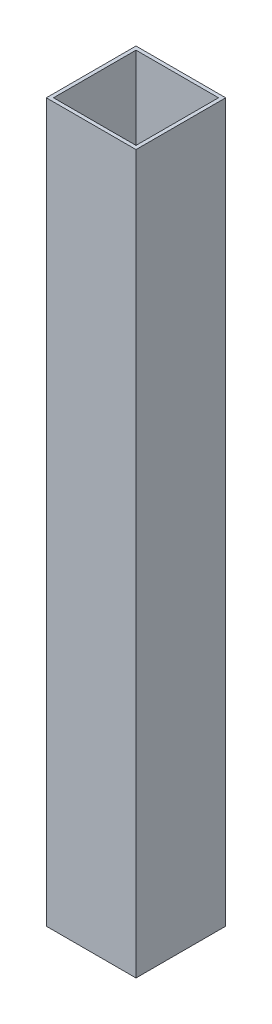
ISO-10303-21;
HEADER;
FILE_DESCRIPTION(('STEP AP214'),'2;1');
FILE_NAME('part.step','',(''),(''),'','','');
FILE_SCHEMA(('AUTOMOTIVE_DESIGN { 1 0 10303 214 1 1 1 1 }'));
ENDSEC;
DATA;
#1=APPLICATION_CONTEXT('core data for automotive mechanical design processes');
#2=APPLICATION_PROTOCOL_DEFINITION('international standard','automotive_design',2000,#1);
#3=PRODUCT_CONTEXT('',#1,'mechanical');
#4=PRODUCT('Part','Part','',(#3));
#5=PRODUCT_RELATED_PRODUCT_CATEGORY('part','',(#4));
#6=PRODUCT_DEFINITION_FORMATION('','',#4);
#7=PRODUCT_DEFINITION_CONTEXT('part definition',#1,'design');
#8=PRODUCT_DEFINITION('design','',#6,#7);
#9=PRODUCT_DEFINITION_SHAPE('','',#8);
#10=(LENGTH_UNIT() NAMED_UNIT(*) SI_UNIT(.MILLI.,.METRE.));
#11=(NAMED_UNIT(*) PLANE_ANGLE_UNIT() SI_UNIT($,.RADIAN.));
#12=(NAMED_UNIT(*) SI_UNIT($,.STERADIAN.) SOLID_ANGLE_UNIT());
#13=UNCERTAINTY_MEASURE_WITH_UNIT(LENGTH_MEASURE(1.E-05),#10,'distance_accuracy_value','');
#14=(GEOMETRIC_REPRESENTATION_CONTEXT(3) GLOBAL_UNCERTAINTY_ASSIGNED_CONTEXT((#13)) GLOBAL_UNIT_ASSIGNED_CONTEXT((#10,
#11,#12)) REPRESENTATION_CONTEXT('',''));
#15=CARTESIAN_POINT('',(0.,0.,0.));
#16=DIRECTION('',(0.,0.,1.));
#17=DIRECTION('',(1.,0.,0.));
#18=AXIS2_PLACEMENT_3D('',#15,#16,#17);
#19=CARTESIAN_POINT('',(0.,800.,0.));
#20=DIRECTION('',(0.,1.,0.));
#21=DIRECTION('',(0.,0.,1.));
#22=AXIS2_PLACEMENT_3D('',#19,#20,#21);
#23=PLANE('',#22);
#24=DIRECTION('',(0.,0.,-1.));
#25=VECTOR('',#24,1.);
#26=CARTESIAN_POINT('',(50.,800.,50.));
#27=LINE('',#26,#25);
#28=CARTESIAN_POINT('',(50.,800.,50.));
#29=VERTEX_POINT('',#28);
#30=CARTESIAN_POINT('',(50.,800.,-50.));
#31=VERTEX_POINT('',#30);
#32=EDGE_CURVE('E177',#29,#31,#27,.T.);
#33=ORIENTED_EDGE('',*,*,#32,.T.);
#34=DIRECTION('',(-1.,0.,0.));
#35=VECTOR('',#34,1.);
#36=CARTESIAN_POINT('',(-50.,800.,-50.));
#37=LINE('',#36,#35);
#38=CARTESIAN_POINT('',(-50.,800.,-50.));
#39=VERTEX_POINT('',#38);
#40=EDGE_CURVE('E181',#31,#39,#37,.T.);
#41=ORIENTED_EDGE('',*,*,#40,.T.);
#42=DIRECTION('',(0.,0.,1.));
#43=VECTOR('',#42,1.);
#44=CARTESIAN_POINT('',(-50.,800.,50.));
#45=LINE('',#44,#43);
#46=CARTESIAN_POINT('',(-50.,800.,50.));
#47=VERTEX_POINT('',#46);
#48=EDGE_CURVE('E185',#39,#47,#45,.T.);
#49=ORIENTED_EDGE('',*,*,#48,.T.);
#50=DIRECTION('',(1.,0.,0.));
#51=VECTOR('',#50,1.);
#52=CARTESIAN_POINT('',(-50.,800.,50.));
#53=LINE('',#52,#51);
#54=EDGE_CURVE('E188',#47,#29,#53,.T.);
#55=ORIENTED_EDGE('',*,*,#54,.T.);
#56=EDGE_LOOP('',(#33,#41,#49,#55));
#57=FACE_BOUND('',#56,.T.);
#58=DIRECTION('',(-1.,0.,0.));
#59=VECTOR('',#58,1.);
#60=CARTESIAN_POINT('',(0.,800.,-46.));
#61=LINE('',#60,#59);
#62=CARTESIAN_POINT('',(46.,800.,-46.));
#63=VERTEX_POINT('',#62);
#64=CARTESIAN_POINT('',(-46.,800.,-46.));
#65=VERTEX_POINT('',#64);
#66=EDGE_CURVE('E138',#63,#65,#61,.T.);
#67=ORIENTED_EDGE('',*,*,#66,.F.);
#68=DIRECTION('',(0.,0.,-1.));
#69=VECTOR('',#68,1.);
#70=CARTESIAN_POINT('',(46.,800.,0.));
#71=LINE('',#70,#69);
#72=CARTESIAN_POINT('',(46.,800.,46.));
#73=VERTEX_POINT('',#72);
#74=EDGE_CURVE('E129',#73,#63,#71,.T.);
#75=ORIENTED_EDGE('',*,*,#74,.F.);
#76=DIRECTION('',(1.,0.,0.));
#77=VECTOR('',#76,1.);
#78=CARTESIAN_POINT('',(0.,800.,46.));
#79=LINE('',#78,#77);
#80=CARTESIAN_POINT('',(-46.,800.,46.));
#81=VERTEX_POINT('',#80);
#82=EDGE_CURVE('E155',#81,#73,#79,.T.);
#83=ORIENTED_EDGE('',*,*,#82,.F.);
#84=DIRECTION('',(0.,0.,1.));
#85=VECTOR('',#84,1.);
#86=CARTESIAN_POINT('',(-46.,800.,0.));
#87=LINE('',#86,#85);
#88=EDGE_CURVE('E151',#65,#81,#87,.T.);
#89=ORIENTED_EDGE('',*,*,#88,.F.);
#90=EDGE_LOOP('',(#67,#75,#83,#89));
#91=FACE_BOUND('',#90,.T.);
#92=ADVANCED_FACE('F63',(#57,#91),#23,.T.);
#93=CARTESIAN_POINT('',(0.,0.,0.));
#94=DIRECTION('',(0.,1.,0.));
#95=DIRECTION('',(0.,0.,1.));
#96=AXIS2_PLACEMENT_3D('',#93,#94,#95);
#97=PLANE('',#96);
#98=DIRECTION('',(0.,0.,-1.));
#99=VECTOR('',#98,1.);
#100=CARTESIAN_POINT('',(50.,0.,50.));
#101=LINE('',#100,#99);
#102=CARTESIAN_POINT('',(50.,0.,50.));
#103=VERTEX_POINT('',#102);
#104=CARTESIAN_POINT('',(50.,0.,-50.));
#105=VERTEX_POINT('',#104);
#106=EDGE_CURVE('E147',#103,#105,#101,.T.);
#107=ORIENTED_EDGE('',*,*,#106,.F.);
#108=DIRECTION('',(1.,0.,0.));
#109=VECTOR('',#108,1.);
#110=CARTESIAN_POINT('',(-50.,0.,50.));
#111=LINE('',#110,#109);
#112=CARTESIAN_POINT('',(-50.,0.,50.));
#113=VERTEX_POINT('',#112);
#114=EDGE_CURVE('E182',#113,#103,#111,.T.);
#115=ORIENTED_EDGE('',*,*,#114,.F.);
#116=DIRECTION('',(0.,0.,1.));
#117=VECTOR('',#116,1.);
#118=CARTESIAN_POINT('',(-50.,0.,50.));
#119=LINE('',#118,#117);
#120=CARTESIAN_POINT('',(-50.,0.,-50.));
#121=VERTEX_POINT('',#120);
#122=EDGE_CURVE('E198',#121,#113,#119,.T.);
#123=ORIENTED_EDGE('',*,*,#122,.F.);
#124=DIRECTION('',(-1.,0.,0.));
#125=VECTOR('',#124,1.);
#126=CARTESIAN_POINT('',(-50.,0.,-50.));
#127=LINE('',#126,#125);
#128=EDGE_CURVE('E195',#105,#121,#127,.T.);
#129=ORIENTED_EDGE('',*,*,#128,.F.);
#130=EDGE_LOOP('',(#107,#115,#123,#129));
#131=FACE_BOUND('',#130,.T.);
#132=DIRECTION('',(0.,0.,-1.));
#133=VECTOR('',#132,1.);
#134=CARTESIAN_POINT('',(46.,0.,0.));
#135=LINE('',#134,#133);
#136=CARTESIAN_POINT('',(46.,0.,46.));
#137=VERTEX_POINT('',#136);
#138=CARTESIAN_POINT('',(46.,0.,-46.));
#139=VERTEX_POINT('',#138);
#140=EDGE_CURVE('E87',#137,#139,#135,.T.);
#141=ORIENTED_EDGE('',*,*,#140,.T.);
#142=DIRECTION('',(-1.,0.,0.));
#143=VECTOR('',#142,1.);
#144=CARTESIAN_POINT('',(0.,0.,-46.));
#145=LINE('',#144,#143);
#146=CARTESIAN_POINT('',(-46.,0.,-46.));
#147=VERTEX_POINT('',#146);
#148=EDGE_CURVE('E145',#139,#147,#145,.T.);
#149=ORIENTED_EDGE('',*,*,#148,.T.);
#150=DIRECTION('',(0.,0.,1.));
#151=VECTOR('',#150,1.);
#152=CARTESIAN_POINT('',(-46.,0.,0.));
#153=LINE('',#152,#151);
#154=CARTESIAN_POINT('',(-46.,0.,46.));
#155=VERTEX_POINT('',#154);
#156=EDGE_CURVE('E164',#147,#155,#153,.T.);
#157=ORIENTED_EDGE('',*,*,#156,.T.);
#158=DIRECTION('',(1.,0.,0.));
#159=VECTOR('',#158,1.);
#160=CARTESIAN_POINT('',(0.,0.,46.));
#161=LINE('',#160,#159);
#162=EDGE_CURVE('E139',#155,#137,#161,.T.);
#163=ORIENTED_EDGE('',*,*,#162,.T.);
#164=EDGE_LOOP('',(#141,#149,#157,#163));
#165=FACE_BOUND('',#164,.T.);
#166=ADVANCED_FACE('F221',(#131,#165),#97,.F.);
#167=CARTESIAN_POINT('',(50.,800.,50.));
#168=DIRECTION('',(-1.,0.,0.));
#169=DIRECTION('',(0.,0.,1.));
#170=AXIS2_PLACEMENT_3D('',#167,#168,#169);
#171=PLANE('',#170);
#172=ORIENTED_EDGE('',*,*,#106,.T.);
#173=DIRECTION('',(0.,-1.,0.));
#174=VECTOR('',#173,1.);
#175=CARTESIAN_POINT('',(50.,800.,-50.));
#176=LINE('',#175,#174);
#177=EDGE_CURVE('E12',#31,#105,#176,.T.);
#178=ORIENTED_EDGE('',*,*,#177,.F.);
#179=ORIENTED_EDGE('',*,*,#32,.F.);
#180=DIRECTION('',(0.,-1.,0.));
#181=VECTOR('',#180,1.);
#182=CARTESIAN_POINT('',(50.,800.,50.));
#183=LINE('',#182,#181);
#184=EDGE_CURVE('E191',#29,#103,#183,.T.);
#185=ORIENTED_EDGE('',*,*,#184,.T.);
#186=EDGE_LOOP('',(#172,#178,#179,#185));
#187=FACE_BOUND('',#186,.T.);
#188=ADVANCED_FACE('F65',(#187),#171,.F.);
#189=CARTESIAN_POINT('',(-50.,800.,-50.));
#190=DIRECTION('',(0.,0.,1.));
#191=DIRECTION('',(1.,0.,0.));
#192=AXIS2_PLACEMENT_3D('',#189,#190,#191);
#193=PLANE('',#192);
#194=ORIENTED_EDGE('',*,*,#128,.T.);
#195=DIRECTION('',(0.,-1.,0.));
#196=VECTOR('',#195,1.);
#197=CARTESIAN_POINT('',(-50.,800.,-50.));
#198=LINE('',#197,#196);
#199=EDGE_CURVE('E72',#39,#121,#198,.T.);
#200=ORIENTED_EDGE('',*,*,#199,.F.);
#201=ORIENTED_EDGE('',*,*,#40,.F.);
#202=ORIENTED_EDGE('',*,*,#177,.T.);
#203=EDGE_LOOP('',(#194,#200,#201,#202));
#204=FACE_BOUND('',#203,.T.);
#205=ADVANCED_FACE('F231',(#204),#193,.F.);
#206=CARTESIAN_POINT('',(-50.,800.,50.));
#207=DIRECTION('',(1.,0.,0.));
#208=DIRECTION('',(0.,0.,-1.));
#209=AXIS2_PLACEMENT_3D('',#206,#207,#208);
#210=PLANE('',#209);
#211=ORIENTED_EDGE('',*,*,#122,.T.);
#212=DIRECTION('',(0.,-1.,0.));
#213=VECTOR('',#212,1.);
#214=CARTESIAN_POINT('',(-50.,800.,50.));
#215=LINE('',#214,#213);
#216=EDGE_CURVE('E206',#47,#113,#215,.T.);
#217=ORIENTED_EDGE('',*,*,#216,.F.);
#218=ORIENTED_EDGE('',*,*,#48,.F.);
#219=ORIENTED_EDGE('',*,*,#199,.T.);
#220=EDGE_LOOP('',(#211,#217,#218,#219));
#221=FACE_BOUND('',#220,.T.);
#222=ADVANCED_FACE('F215',(#221),#210,.F.);
#223=CARTESIAN_POINT('',(-50.,800.,50.));
#224=DIRECTION('',(0.,0.,-1.));
#225=DIRECTION('',(-1.,0.,0.));
#226=AXIS2_PLACEMENT_3D('',#223,#224,#225);
#227=PLANE('',#226);
#228=ORIENTED_EDGE('',*,*,#114,.T.);
#229=ORIENTED_EDGE('',*,*,#184,.F.);
#230=ORIENTED_EDGE('',*,*,#54,.F.);
#231=ORIENTED_EDGE('',*,*,#216,.T.);
#232=EDGE_LOOP('',(#228,#229,#230,#231));
#233=FACE_BOUND('',#232,.T.);
#234=ADVANCED_FACE('F225',(#233),#227,.F.);
#235=CARTESIAN_POINT('',(46.,800.,0.));
#236=DIRECTION('',(-1.,0.,0.));
#237=DIRECTION('',(0.,0.,1.));
#238=AXIS2_PLACEMENT_3D('',#235,#236,#237);
#239=PLANE('',#238);
#240=ORIENTED_EDGE('',*,*,#140,.F.);
#241=DIRECTION('',(0.,-1.,0.));
#242=VECTOR('',#241,1.);
#243=CARTESIAN_POINT('',(46.,800.,46.));
#244=LINE('',#243,#242);
#245=EDGE_CURVE('E133',#73,#137,#244,.T.);
#246=ORIENTED_EDGE('',*,*,#245,.F.);
#247=ORIENTED_EDGE('',*,*,#74,.T.);
#248=DIRECTION('',(0.,-1.,0.));
#249=VECTOR('',#248,1.);
#250=CARTESIAN_POINT('',(46.,800.,-46.));
#251=LINE('',#250,#249);
#252=EDGE_CURVE('E132',#63,#139,#251,.T.);
#253=ORIENTED_EDGE('',*,*,#252,.T.);
#254=EDGE_LOOP('',(#240,#246,#247,#253));
#255=FACE_BOUND('',#254,.T.);
#256=ADVANCED_FACE('F131',(#255),#239,.T.);
#257=CARTESIAN_POINT('',(0.,800.,-46.));
#258=DIRECTION('',(0.,0.,1.));
#259=DIRECTION('',(1.,0.,0.));
#260=AXIS2_PLACEMENT_3D('',#257,#258,#259);
#261=PLANE('',#260);
#262=ORIENTED_EDGE('',*,*,#148,.F.);
#263=ORIENTED_EDGE('',*,*,#252,.F.);
#264=ORIENTED_EDGE('',*,*,#66,.T.);
#265=DIRECTION('',(0.,-1.,0.));
#266=VECTOR('',#265,1.);
#267=CARTESIAN_POINT('',(-46.,800.,-46.));
#268=LINE('',#267,#266);
#269=EDGE_CURVE('E148',#65,#147,#268,.T.);
#270=ORIENTED_EDGE('',*,*,#269,.T.);
#271=EDGE_LOOP('',(#262,#263,#264,#270));
#272=FACE_BOUND('',#271,.T.);
#273=ADVANCED_FACE('F142',(#272),#261,.T.);
#274=CARTESIAN_POINT('',(-46.,800.,0.));
#275=DIRECTION('',(1.,0.,0.));
#276=DIRECTION('',(0.,0.,-1.));
#277=AXIS2_PLACEMENT_3D('',#274,#275,#276);
#278=PLANE('',#277);
#279=ORIENTED_EDGE('',*,*,#156,.F.);
#280=ORIENTED_EDGE('',*,*,#269,.F.);
#281=ORIENTED_EDGE('',*,*,#88,.T.);
#282=DIRECTION('',(0.,-1.,0.));
#283=VECTOR('',#282,1.);
#284=CARTESIAN_POINT('',(-46.,800.,46.));
#285=LINE('',#284,#283);
#286=EDGE_CURVE('E79',#81,#155,#285,.T.);
#287=ORIENTED_EDGE('',*,*,#286,.T.);
#288=EDGE_LOOP('',(#279,#280,#281,#287));
#289=FACE_BOUND('',#288,.T.);
#290=ADVANCED_FACE('F254',(#289),#278,.T.);
#291=CARTESIAN_POINT('',(0.,800.,46.));
#292=DIRECTION('',(0.,0.,-1.));
#293=DIRECTION('',(-1.,0.,0.));
#294=AXIS2_PLACEMENT_3D('',#291,#292,#293);
#295=PLANE('',#294);
#296=ORIENTED_EDGE('',*,*,#162,.F.);
#297=ORIENTED_EDGE('',*,*,#286,.F.);
#298=ORIENTED_EDGE('',*,*,#82,.T.);
#299=ORIENTED_EDGE('',*,*,#245,.T.);
#300=EDGE_LOOP('',(#296,#297,#298,#299));
#301=FACE_BOUND('',#300,.T.);
#302=ADVANCED_FACE('F258',(#301),#295,.T.);
#303=CLOSED_SHELL('',(#92,#166,#188,#205,#222,#234,#256,#273,#290,#302));
#304=MANIFOLD_SOLID_BREP('B2',#303);
#305=ADVANCED_BREP_SHAPE_REPRESENTATION('',(#18,#304),#14);
#306=SHAPE_DEFINITION_REPRESENTATION(#9,#305);
ENDSEC;
END-ISO-10303-21;
